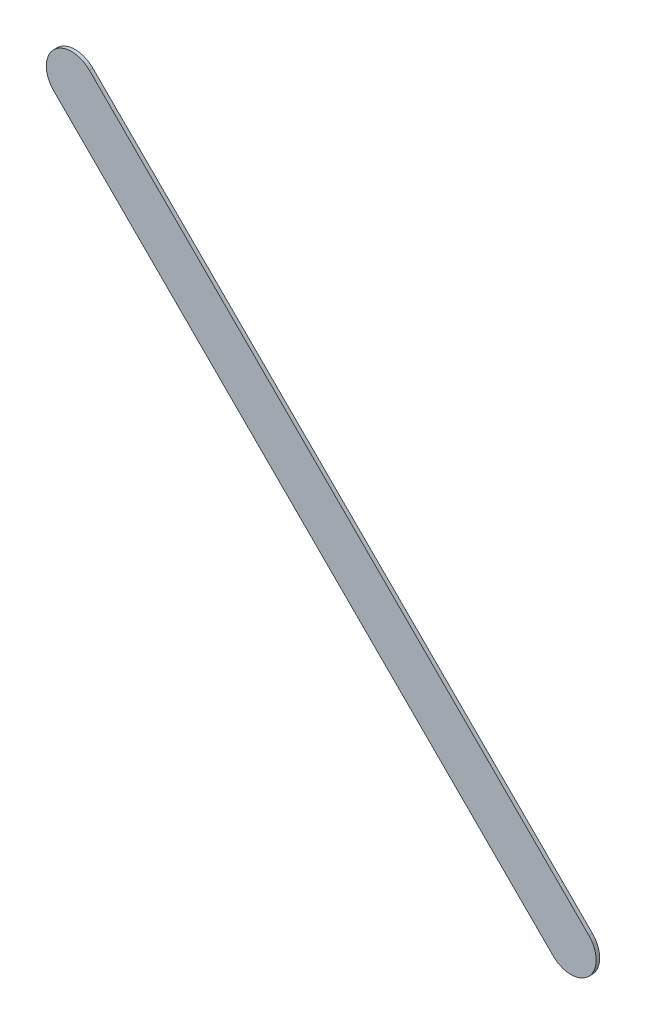
ISO-10303-21;
HEADER;
FILE_DESCRIPTION(('STEP AP214'),'2;1');
FILE_NAME('part.step','',(''),(''),'','','');
FILE_SCHEMA(('AUTOMOTIVE_DESIGN { 1 0 10303 214 1 1 1 1 }'));
ENDSEC;
DATA;
#1=APPLICATION_CONTEXT('core data for automotive mechanical design processes');
#2=APPLICATION_PROTOCOL_DEFINITION('international standard','automotive_design',2000,#1);
#3=PRODUCT_CONTEXT('',#1,'mechanical');
#4=PRODUCT('Part','Part','',(#3));
#5=PRODUCT_RELATED_PRODUCT_CATEGORY('part','',(#4));
#6=PRODUCT_DEFINITION_FORMATION('','',#4);
#7=PRODUCT_DEFINITION_CONTEXT('part definition',#1,'design');
#8=PRODUCT_DEFINITION('design','',#6,#7);
#9=PRODUCT_DEFINITION_SHAPE('','',#8);
#10=(LENGTH_UNIT() NAMED_UNIT(*) SI_UNIT(.MILLI.,.METRE.));
#11=(NAMED_UNIT(*) PLANE_ANGLE_UNIT() SI_UNIT($,.RADIAN.));
#12=(NAMED_UNIT(*) SI_UNIT($,.STERADIAN.) SOLID_ANGLE_UNIT());
#13=UNCERTAINTY_MEASURE_WITH_UNIT(LENGTH_MEASURE(1.E-05),#10,'distance_accuracy_value','');
#14=(GEOMETRIC_REPRESENTATION_CONTEXT(3) GLOBAL_UNCERTAINTY_ASSIGNED_CONTEXT((#13)) GLOBAL_UNIT_ASSIGNED_CONTEXT((#10,
#11,#12)) REPRESENTATION_CONTEXT('',''));
#15=CARTESIAN_POINT('',(0.,0.,0.));
#16=DIRECTION('',(0.,0.,1.));
#17=DIRECTION('',(1.,0.,0.));
#18=AXIS2_PLACEMENT_3D('',#15,#16,#17);
#19=CARTESIAN_POINT('',(124.255776,-116.028223,0.));
#20=DIRECTION('',(0.,0.,1.));
#21=DIRECTION('',(1.,0.,0.));
#22=AXIS2_PLACEMENT_3D('',#19,#20,#21);
#23=PLANE('',#22);
#24=DIRECTION('',(-0.707106781186548,0.707106781186548,0.));
#25=VECTOR('',#24,1.);
#26=CARTESIAN_POINT('',(124.255776,-116.028223,0.));
#27=LINE('',#26,#25);
#28=CARTESIAN_POINT('',(124.255776,-116.028223,0.));
#29=VERTEX_POINT('',#28);
#30=CARTESIAN_POINT('',(119.302776,-111.075223,0.));
#31=VERTEX_POINT('',#30);
#32=EDGE_CURVE('E81',#29,#31,#27,.T.);
#33=ORIENTED_EDGE('',*,*,#32,.T.);
#34=CARTESIAN_POINT('',(119.1259995,-111.2519995,0.));
#35=DIRECTION('',(0.,0.,1.));
#36=DIRECTION('',(0.707106781186548,0.707106781186548,0.));
#37=AXIS2_PLACEMENT_3D('',#34,#35,#36);
#38=CIRCLE('',#37,0.249999723809);
#39=CARTESIAN_POINT('',(118.949223,-111.428776,0.));
#40=VERTEX_POINT('',#39);
#41=EDGE_CURVE('E104',#31,#40,#38,.T.);
#42=ORIENTED_EDGE('',*,*,#41,.T.);
#43=DIRECTION('',(0.707106781186548,-0.707106781186548,0.));
#44=VECTOR('',#43,1.);
#45=CARTESIAN_POINT('',(118.949223,-111.428776,0.));
#46=LINE('',#45,#44);
#47=CARTESIAN_POINT('',(123.902223,-116.381776,0.));
#48=VERTEX_POINT('',#47);
#49=EDGE_CURVE('E74',#40,#48,#46,.T.);
#50=ORIENTED_EDGE('',*,*,#49,.T.);
#51=CARTESIAN_POINT('',(124.0789995,-116.2049995,0.));
#52=DIRECTION('',(0.,0.,1.));
#53=DIRECTION('',(-0.707106781186548,-0.707106781186548,0.));
#54=AXIS2_PLACEMENT_3D('',#51,#52,#53);
#55=CIRCLE('',#54,0.249999723809);
#56=EDGE_CURVE('E11',#48,#29,#55,.T.);
#57=ORIENTED_EDGE('',*,*,#56,.T.);
#58=EDGE_LOOP('',(#33,#42,#50,#57));
#59=FACE_BOUND('',#58,.T.);
#60=ADVANCED_FACE('F17',(#59),#23,.T.);
#61=CARTESIAN_POINT('',(124.255776,-116.028223,-0.035));
#62=DIRECTION('',(0.,0.,1.));
#63=DIRECTION('',(1.,0.,0.));
#64=AXIS2_PLACEMENT_3D('',#61,#62,#63);
#65=PLANE('',#64);
#66=CARTESIAN_POINT('',(124.0789995,-116.2049995,-0.035));
#67=DIRECTION('',(0.,0.,1.));
#68=DIRECTION('',(-0.707106781186548,-0.707106781186548,0.));
#69=AXIS2_PLACEMENT_3D('',#66,#67,#68);
#70=CIRCLE('',#69,0.249999723809);
#71=CARTESIAN_POINT('',(123.902223,-116.381776,-0.035));
#72=VERTEX_POINT('',#71);
#73=CARTESIAN_POINT('',(124.255776,-116.028223,-0.035));
#74=VERTEX_POINT('',#73);
#75=EDGE_CURVE('E25',#72,#74,#70,.T.);
#76=ORIENTED_EDGE('',*,*,#75,.F.);
#77=DIRECTION('',(0.707106781186548,-0.707106781186548,0.));
#78=VECTOR('',#77,1.);
#79=CARTESIAN_POINT('',(118.949223,-111.428776,-0.035));
#80=LINE('',#79,#78);
#81=CARTESIAN_POINT('',(118.949223,-111.428776,-0.035));
#82=VERTEX_POINT('',#81);
#83=EDGE_CURVE('E108',#82,#72,#80,.T.);
#84=ORIENTED_EDGE('',*,*,#83,.F.);
#85=CARTESIAN_POINT('',(119.1259995,-111.2519995,-0.035));
#86=DIRECTION('',(0.,0.,1.));
#87=DIRECTION('',(0.707106781186548,0.707106781186548,0.));
#88=AXIS2_PLACEMENT_3D('',#85,#86,#87);
#89=CIRCLE('',#88,0.249999723809);
#90=CARTESIAN_POINT('',(119.302776,-111.075223,-0.035));
#91=VERTEX_POINT('',#90);
#92=EDGE_CURVE('E83',#91,#82,#89,.T.);
#93=ORIENTED_EDGE('',*,*,#92,.F.);
#94=DIRECTION('',(-0.707106781186548,0.707106781186548,0.));
#95=VECTOR('',#94,1.);
#96=CARTESIAN_POINT('',(124.255776,-116.028223,-0.035));
#97=LINE('',#96,#95);
#98=EDGE_CURVE('E79',#74,#91,#97,.T.);
#99=ORIENTED_EDGE('',*,*,#98,.F.);
#100=EDGE_LOOP('',(#76,#84,#93,#99));
#101=FACE_BOUND('',#100,.T.);
#102=ADVANCED_FACE('F85',(#101),#65,.F.);
#103=CARTESIAN_POINT('',(124.0789995,-116.2049995,-0.035));
#104=DIRECTION('',(0.,0.,-1.));
#105=DIRECTION('',(-0.707106781186548,-0.707106781186548,0.));
#106=AXIS2_PLACEMENT_3D('',#103,#104,#105);
#107=CYLINDRICAL_SURFACE('',#106,0.249999723809);
#108=ORIENTED_EDGE('',*,*,#75,.T.);
#109=DIRECTION('',(0.,0.,1.));
#110=VECTOR('',#109,1.);
#111=CARTESIAN_POINT('',(124.255776,-116.028223,-0.035));
#112=LINE('',#111,#110);
#113=EDGE_CURVE('E68',#74,#29,#112,.T.);
#114=ORIENTED_EDGE('',*,*,#113,.T.);
#115=ORIENTED_EDGE('',*,*,#56,.F.);
#116=DIRECTION('',(0.,0.,1.));
#117=VECTOR('',#116,1.);
#118=CARTESIAN_POINT('',(123.902223,-116.381776,-0.035));
#119=LINE('',#118,#117);
#120=EDGE_CURVE('E71',#72,#48,#119,.T.);
#121=ORIENTED_EDGE('',*,*,#120,.F.);
#122=EDGE_LOOP('',(#108,#114,#115,#121));
#123=FACE_BOUND('',#122,.T.);
#124=ADVANCED_FACE('F67',(#123),#107,.T.);
#125=CARTESIAN_POINT('',(118.949223,-111.428776,-0.035));
#126=DIRECTION('',(0.707106781186548,0.707106781186548,0.));
#127=DIRECTION('',(0.,0.,-1.));
#128=AXIS2_PLACEMENT_3D('',#125,#126,#127);
#129=PLANE('',#128);
#130=ORIENTED_EDGE('',*,*,#83,.T.);
#131=ORIENTED_EDGE('',*,*,#120,.T.);
#132=ORIENTED_EDGE('',*,*,#49,.F.);
#133=DIRECTION('',(0.,0.,1.));
#134=VECTOR('',#133,1.);
#135=CARTESIAN_POINT('',(118.949223,-111.428776,-0.035));
#136=LINE('',#135,#134);
#137=EDGE_CURVE('E100',#82,#40,#136,.T.);
#138=ORIENTED_EDGE('',*,*,#137,.F.);
#139=EDGE_LOOP('',(#130,#131,#132,#138));
#140=FACE_BOUND('',#139,.T.);
#141=ADVANCED_FACE('F117',(#140),#129,.F.);
#142=CARTESIAN_POINT('',(119.1259995,-111.2519995,-0.035));
#143=DIRECTION('',(0.,0.,-1.));
#144=DIRECTION('',(0.707106781186548,0.707106781186548,0.));
#145=AXIS2_PLACEMENT_3D('',#142,#143,#144);
#146=CYLINDRICAL_SURFACE('',#145,0.249999723809);
#147=ORIENTED_EDGE('',*,*,#92,.T.);
#148=ORIENTED_EDGE('',*,*,#137,.T.);
#149=ORIENTED_EDGE('',*,*,#41,.F.);
#150=DIRECTION('',(0.,0.,1.));
#151=VECTOR('',#150,1.);
#152=CARTESIAN_POINT('',(119.302776,-111.075223,-0.035));
#153=LINE('',#152,#151);
#154=EDGE_CURVE('E89',#91,#31,#153,.T.);
#155=ORIENTED_EDGE('',*,*,#154,.F.);
#156=EDGE_LOOP('',(#147,#148,#149,#155));
#157=FACE_BOUND('',#156,.T.);
#158=ADVANCED_FACE('F120',(#157),#146,.T.);
#159=CARTESIAN_POINT('',(124.255776,-116.028223,-0.035));
#160=DIRECTION('',(-0.707106781186548,-0.707106781186548,0.));
#161=DIRECTION('',(-0.707106781186548,0.707106781186548,0.));
#162=AXIS2_PLACEMENT_3D('',#159,#160,#161);
#163=PLANE('',#162);
#164=ORIENTED_EDGE('',*,*,#98,.T.);
#165=ORIENTED_EDGE('',*,*,#154,.T.);
#166=ORIENTED_EDGE('',*,*,#32,.F.);
#167=ORIENTED_EDGE('',*,*,#113,.F.);
#168=EDGE_LOOP('',(#164,#165,#166,#167));
#169=FACE_BOUND('',#168,.T.);
#170=ADVANCED_FACE('F77',(#169),#163,.F.);
#171=CLOSED_SHELL('',(#60,#102,#124,#141,#158,#170));
#172=MANIFOLD_SOLID_BREP('B1',#171);
#173=ADVANCED_BREP_SHAPE_REPRESENTATION('',(#18,#172),#14);
#174=SHAPE_DEFINITION_REPRESENTATION(#9,#173);
ENDSEC;
END-ISO-10303-21;
